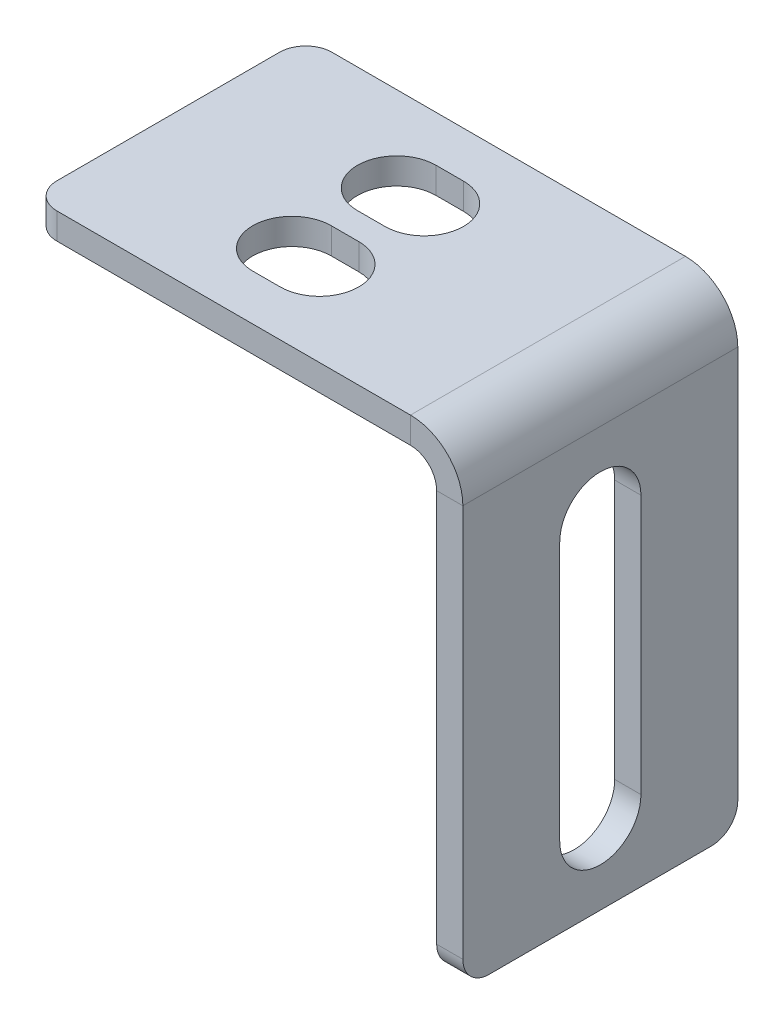
ISO-10303-21;
HEADER;
FILE_DESCRIPTION(('STEP AP214'),'2;1');
FILE_NAME('part.step','',(''),(''),'','','');
FILE_SCHEMA(('AUTOMOTIVE_DESIGN { 1 0 10303 214 1 1 1 1 }'));
ENDSEC;
DATA;
#1=APPLICATION_CONTEXT('core data for automotive mechanical design processes');
#2=APPLICATION_PROTOCOL_DEFINITION('international standard','automotive_design',2000,#1);
#3=PRODUCT_CONTEXT('',#1,'mechanical');
#4=PRODUCT('Part','Part','',(#3));
#5=PRODUCT_RELATED_PRODUCT_CATEGORY('part','',(#4));
#6=PRODUCT_DEFINITION_FORMATION('','',#4);
#7=PRODUCT_DEFINITION_CONTEXT('part definition',#1,'design');
#8=PRODUCT_DEFINITION('design','',#6,#7);
#9=PRODUCT_DEFINITION_SHAPE('','',#8);
#10=(LENGTH_UNIT() NAMED_UNIT(*) SI_UNIT(.MILLI.,.METRE.));
#11=(NAMED_UNIT(*) PLANE_ANGLE_UNIT() SI_UNIT($,.RADIAN.));
#12=(NAMED_UNIT(*) SI_UNIT($,.STERADIAN.) SOLID_ANGLE_UNIT());
#13=UNCERTAINTY_MEASURE_WITH_UNIT(LENGTH_MEASURE(1.E-05),#10,'distance_accuracy_value','');
#14=(GEOMETRIC_REPRESENTATION_CONTEXT(3) GLOBAL_UNCERTAINTY_ASSIGNED_CONTEXT((#13)) GLOBAL_UNIT_ASSIGNED_CONTEXT((#10,
#11,#12)) REPRESENTATION_CONTEXT('',''));
#15=CARTESIAN_POINT('',(0.,0.,0.));
#16=DIRECTION('',(0.,0.,1.));
#17=DIRECTION('',(1.,0.,0.));
#18=AXIS2_PLACEMENT_3D('',#15,#16,#17);
#19=CARTESIAN_POINT('',(-2.,0.,0.));
#20=DIRECTION('',(0.,0.,1.));
#21=DIRECTION('',(0.,1.,0.));
#22=AXIS2_PLACEMENT_3D('',#19,#20,#21);
#23=PLANE('',#22);
#24=DIRECTION('',(0.,-1.,0.));
#25=VECTOR('',#24,1.);
#26=CARTESIAN_POINT('',(0.,0.,0.));
#27=LINE('',#26,#25);
#28=CARTESIAN_POINT('',(0.,-34.,0.));
#29=VERTEX_POINT('',#28);
#30=CARTESIAN_POINT('',(0.,-4.,0.));
#31=VERTEX_POINT('',#30);
#32=EDGE_CURVE('E327',#29,#31,#27,.F.);
#33=ORIENTED_EDGE('',*,*,#32,.F.);
#34=DIRECTION('',(1.,0.,0.));
#35=VECTOR('',#34,1.);
#36=CARTESIAN_POINT('',(-2.,-34.,0.));
#37=LINE('',#36,#35);
#38=CARTESIAN_POINT('',(-2.,-34.,0.));
#39=VERTEX_POINT('',#38);
#40=EDGE_CURVE('E341',#29,#39,#37,.F.);
#41=ORIENTED_EDGE('',*,*,#40,.T.);
#42=DIRECTION('',(0.,1.,0.));
#43=VECTOR('',#42,1.);
#44=CARTESIAN_POINT('',(-2.,0.,0.));
#45=LINE('',#44,#43);
#46=CARTESIAN_POINT('',(-2.,-4.,0.));
#47=VERTEX_POINT('',#46);
#48=EDGE_CURVE('E280',#39,#47,#45,.T.);
#49=ORIENTED_EDGE('',*,*,#48,.T.);
#50=DIRECTION('',(-1.,0.,0.));
#51=VECTOR('',#50,1.);
#52=CARTESIAN_POINT('',(-2.,-4.,0.));
#53=LINE('',#52,#51);
#54=EDGE_CURVE('E338',#31,#47,#53,.T.);
#55=ORIENTED_EDGE('',*,*,#54,.F.);
#56=EDGE_LOOP('',(#33,#41,#49,#55));
#57=FACE_BOUND('',#56,.T.);
#58=ADVANCED_FACE('F16',(#57),#23,.F.);
#59=CARTESIAN_POINT('',(-2.,-36.,70.8364617882991));
#60=DIRECTION('',(0.,1.,0.));
#61=DIRECTION('',(0.,0.,-1.));
#62=AXIS2_PLACEMENT_3D('',#59,#60,#61);
#63=PLANE('',#62);
#64=DIRECTION('',(0.,0.,-1.));
#65=VECTOR('',#64,1.);
#66=CARTESIAN_POINT('',(-2.,-36.,70.8364617882991));
#67=LINE('',#66,#65);
#68=CARTESIAN_POINT('',(-2.,-36.,19.));
#69=VERTEX_POINT('',#68);
#70=CARTESIAN_POINT('',(-2.,-36.,2.));
#71=VERTEX_POINT('',#70);
#72=EDGE_CURVE('E283',#69,#71,#67,.T.);
#73=ORIENTED_EDGE('',*,*,#72,.T.);
#74=DIRECTION('',(1.,0.,0.));
#75=VECTOR('',#74,1.);
#76=CARTESIAN_POINT('',(-2.,-36.,2.));
#77=LINE('',#76,#75);
#78=CARTESIAN_POINT('',(0.,-36.,2.));
#79=VERTEX_POINT('',#78);
#80=EDGE_CURVE('E352',#71,#79,#77,.T.);
#81=ORIENTED_EDGE('',*,*,#80,.T.);
#82=DIRECTION('',(0.,0.,1.));
#83=VECTOR('',#82,1.);
#84=CARTESIAN_POINT('',(0.,-36.,70.8364617882991));
#85=LINE('',#84,#83);
#86=CARTESIAN_POINT('',(0.,-36.,19.));
#87=VERTEX_POINT('',#86);
#88=EDGE_CURVE('E320',#87,#79,#85,.F.);
#89=ORIENTED_EDGE('',*,*,#88,.F.);
#90=DIRECTION('',(1.,0.,0.));
#91=VECTOR('',#90,1.);
#92=CARTESIAN_POINT('',(-2.,-36.,19.));
#93=LINE('',#92,#91);
#94=EDGE_CURVE('E349',#87,#69,#93,.F.);
#95=ORIENTED_EDGE('',*,*,#94,.T.);
#96=EDGE_LOOP('',(#73,#81,#89,#95));
#97=FACE_BOUND('',#96,.T.);
#98=ADVANCED_FACE('F431',(#97),#63,.F.);
#99=CARTESIAN_POINT('',(-2.,0.,21.));
#100=DIRECTION('',(0.,0.,-1.));
#101=DIRECTION('',(0.,-1.,0.));
#102=AXIS2_PLACEMENT_3D('',#99,#100,#101);
#103=PLANE('',#102);
#104=DIRECTION('',(0.,-1.,0.));
#105=VECTOR('',#104,1.);
#106=CARTESIAN_POINT('',(-2.,0.,21.));
#107=LINE('',#106,#105);
#108=CARTESIAN_POINT('',(-2.,-4.,21.));
#109=VERTEX_POINT('',#108);
#110=CARTESIAN_POINT('',(-2.,-34.,21.));
#111=VERTEX_POINT('',#110);
#112=EDGE_CURVE('E277',#109,#111,#107,.T.);
#113=ORIENTED_EDGE('',*,*,#112,.T.);
#114=DIRECTION('',(1.,0.,0.));
#115=VECTOR('',#114,1.);
#116=CARTESIAN_POINT('',(-2.,-34.,21.));
#117=LINE('',#116,#115);
#118=CARTESIAN_POINT('',(0.,-34.,21.));
#119=VERTEX_POINT('',#118);
#120=EDGE_CURVE('E358',#111,#119,#117,.T.);
#121=ORIENTED_EDGE('',*,*,#120,.T.);
#122=DIRECTION('',(0.,-1.,0.));
#123=VECTOR('',#122,1.);
#124=CARTESIAN_POINT('',(0.,0.,21.));
#125=LINE('',#124,#123);
#126=CARTESIAN_POINT('',(0.,-4.,21.));
#127=VERTEX_POINT('',#126);
#128=EDGE_CURVE('E324',#127,#119,#125,.T.);
#129=ORIENTED_EDGE('',*,*,#128,.F.);
#130=DIRECTION('',(-1.,0.,0.));
#131=VECTOR('',#130,1.);
#132=CARTESIAN_POINT('',(-2.,-4.,21.));
#133=LINE('',#132,#131);
#134=EDGE_CURVE('E336',#127,#109,#133,.T.);
#135=ORIENTED_EDGE('',*,*,#134,.T.);
#136=EDGE_LOOP('',(#113,#121,#129,#135));
#137=FACE_BOUND('',#136,.T.);
#138=ADVANCED_FACE('F424',(#137),#103,.F.);
#139=CARTESIAN_POINT('',(-4.,-4.,21.));
#140=DIRECTION('',(0.,0.,1.));
#141=DIRECTION('',(1.,0.,0.));
#142=AXIS2_PLACEMENT_3D('',#139,#140,#141);
#143=PLANE('',#142);
#144=ORIENTED_EDGE('',*,*,#134,.F.);
#145=CARTESIAN_POINT('',(-4.,-4.,21.));
#146=DIRECTION('',(0.,0.,1.));
#147=DIRECTION('',(1.,0.,0.));
#148=AXIS2_PLACEMENT_3D('',#145,#146,#147);
#149=CIRCLE('',#148,4.);
#150=CARTESIAN_POINT('',(-4.,0.,21.));
#151=VERTEX_POINT('',#150);
#152=EDGE_CURVE('E321',#127,#151,#149,.T.);
#153=ORIENTED_EDGE('',*,*,#152,.T.);
#154=DIRECTION('',(0.,-1.,0.));
#155=VECTOR('',#154,1.);
#156=CARTESIAN_POINT('',(-4.,-2.,21.));
#157=LINE('',#156,#155);
#158=CARTESIAN_POINT('',(-4.,-2.,21.));
#159=VERTEX_POINT('',#158);
#160=EDGE_CURVE('E333',#151,#159,#157,.T.);
#161=ORIENTED_EDGE('',*,*,#160,.T.);
#162=CARTESIAN_POINT('',(-4.,-4.,21.));
#163=DIRECTION('',(0.,0.,-1.));
#164=DIRECTION('',(-1.,0.,0.));
#165=AXIS2_PLACEMENT_3D('',#162,#163,#164);
#166=CIRCLE('',#165,2.);
#167=EDGE_CURVE('E281',#109,#159,#166,.F.);
#168=ORIENTED_EDGE('',*,*,#167,.F.);
#169=EDGE_LOOP('',(#144,#153,#161,#168));
#170=FACE_BOUND('',#169,.T.);
#171=ADVANCED_FACE('F417',(#170),#143,.T.);
#172=CARTESIAN_POINT('',(0.,-2.,21.));
#173=DIRECTION('',(0.,0.,-1.));
#174=DIRECTION('',(1.,0.,0.));
#175=AXIS2_PLACEMENT_3D('',#172,#173,#174);
#176=PLANE('',#175);
#177=DIRECTION('',(1.,0.,0.));
#178=VECTOR('',#177,1.);
#179=CARTESIAN_POINT('',(0.,0.,21.));
#180=LINE('',#179,#178);
#181=CARTESIAN_POINT('',(-31.,0.,21.));
#182=VERTEX_POINT('',#181);
#183=EDGE_CURVE('E318',#182,#151,#180,.T.);
#184=ORIENTED_EDGE('',*,*,#183,.F.);
#185=DIRECTION('',(0.,-1.,0.));
#186=VECTOR('',#185,1.);
#187=CARTESIAN_POINT('',(-31.,-2.,21.));
#188=LINE('',#187,#186);
#189=CARTESIAN_POINT('',(-31.,-2.,21.));
#190=VERTEX_POINT('',#189);
#191=EDGE_CURVE('E360',#182,#190,#188,.T.);
#192=ORIENTED_EDGE('',*,*,#191,.T.);
#193=DIRECTION('',(1.,0.,0.));
#194=VECTOR('',#193,1.);
#195=CARTESIAN_POINT('',(0.,-2.,21.));
#196=LINE('',#195,#194);
#197=EDGE_CURVE('E286',#190,#159,#196,.T.);
#198=ORIENTED_EDGE('',*,*,#197,.T.);
#199=ORIENTED_EDGE('',*,*,#160,.F.);
#200=EDGE_LOOP('',(#184,#192,#198,#199));
#201=FACE_BOUND('',#200,.T.);
#202=ADVANCED_FACE('F384',(#201),#176,.F.);
#203=CARTESIAN_POINT('',(-33.,-2.,70.8364617882991));
#204=DIRECTION('',(-1.,0.,0.));
#205=DIRECTION('',(0.,0.,-1.));
#206=AXIS2_PLACEMENT_3D('',#203,#204,#205);
#207=PLANE('',#206);
#208=DIRECTION('',(0.,0.,-1.));
#209=VECTOR('',#208,1.);
#210=CARTESIAN_POINT('',(-33.,-2.,70.8364617882991));
#211=LINE('',#210,#209);
#212=CARTESIAN_POINT('',(-33.,-2.,19.));
#213=VERTEX_POINT('',#212);
#214=CARTESIAN_POINT('',(-33.,-2.,2.));
#215=VERTEX_POINT('',#214);
#216=EDGE_CURVE('E288',#213,#215,#211,.T.);
#217=ORIENTED_EDGE('',*,*,#216,.F.);
#218=DIRECTION('',(0.,1.,0.));
#219=VECTOR('',#218,1.);
#220=CARTESIAN_POINT('',(-33.,-2.,19.));
#221=LINE('',#220,#219);
#222=CARTESIAN_POINT('',(-33.,0.,19.));
#223=VERTEX_POINT('',#222);
#224=EDGE_CURVE('E370',#213,#223,#221,.T.);
#225=ORIENTED_EDGE('',*,*,#224,.T.);
#226=DIRECTION('',(0.,0.,1.));
#227=VECTOR('',#226,1.);
#228=CARTESIAN_POINT('',(-33.,0.,70.8364617882991));
#229=LINE('',#228,#227);
#230=CARTESIAN_POINT('',(-33.,0.,2.));
#231=VERTEX_POINT('',#230);
#232=EDGE_CURVE('E315',#223,#231,#229,.F.);
#233=ORIENTED_EDGE('',*,*,#232,.T.);
#234=DIRECTION('',(0.,1.,0.));
#235=VECTOR('',#234,1.);
#236=CARTESIAN_POINT('',(-33.,-2.,2.));
#237=LINE('',#236,#235);
#238=EDGE_CURVE('E367',#231,#215,#237,.F.);
#239=ORIENTED_EDGE('',*,*,#238,.T.);
#240=EDGE_LOOP('',(#217,#225,#233,#239));
#241=FACE_BOUND('',#240,.T.);
#242=ADVANCED_FACE('F391',(#241),#207,.T.);
#243=CARTESIAN_POINT('',(0.,-2.,0.));
#244=DIRECTION('',(0.,0.,1.));
#245=DIRECTION('',(-1.,0.,0.));
#246=AXIS2_PLACEMENT_3D('',#243,#244,#245);
#247=PLANE('',#246);
#248=DIRECTION('',(-1.,0.,0.));
#249=VECTOR('',#248,1.);
#250=CARTESIAN_POINT('',(0.,-2.,0.));
#251=LINE('',#250,#249);
#252=CARTESIAN_POINT('',(-4.,-2.,0.));
#253=VERTEX_POINT('',#252);
#254=CARTESIAN_POINT('',(-31.,-2.,0.));
#255=VERTEX_POINT('',#254);
#256=EDGE_CURVE('E291',#253,#255,#251,.T.);
#257=ORIENTED_EDGE('',*,*,#256,.T.);
#258=DIRECTION('',(0.,-1.,0.));
#259=VECTOR('',#258,1.);
#260=CARTESIAN_POINT('',(-31.,-2.,0.));
#261=LINE('',#260,#259);
#262=CARTESIAN_POINT('',(-31.,0.,0.));
#263=VERTEX_POINT('',#262);
#264=EDGE_CURVE('E10',#255,#263,#261,.F.);
#265=ORIENTED_EDGE('',*,*,#264,.T.);
#266=DIRECTION('',(1.,0.,0.));
#267=VECTOR('',#266,1.);
#268=CARTESIAN_POINT('',(0.,0.,0.));
#269=LINE('',#268,#267);
#270=CARTESIAN_POINT('',(-4.,0.,0.));
#271=VERTEX_POINT('',#270);
#272=EDGE_CURVE('E312',#271,#263,#269,.F.);
#273=ORIENTED_EDGE('',*,*,#272,.F.);
#274=DIRECTION('',(0.,-1.,0.));
#275=VECTOR('',#274,1.);
#276=CARTESIAN_POINT('',(-4.,-2.,0.));
#277=LINE('',#276,#275);
#278=EDGE_CURVE('E300',#271,#253,#277,.T.);
#279=ORIENTED_EDGE('',*,*,#278,.T.);
#280=EDGE_LOOP('',(#257,#265,#273,#279));
#281=FACE_BOUND('',#280,.T.);
#282=ADVANCED_FACE('F399',(#281),#247,.F.);
#283=CARTESIAN_POINT('',(-4.,-4.,0.));
#284=DIRECTION('',(0.,0.,-1.));
#285=DIRECTION('',(-1.,0.,0.));
#286=AXIS2_PLACEMENT_3D('',#283,#284,#285);
#287=PLANE('',#286);
#288=CARTESIAN_POINT('',(-4.,-4.,0.));
#289=DIRECTION('',(0.,0.,1.));
#290=DIRECTION('',(1.,0.,0.));
#291=AXIS2_PLACEMENT_3D('',#288,#289,#290);
#292=CIRCLE('',#291,4.);
#293=EDGE_CURVE('E246',#271,#31,#292,.F.);
#294=ORIENTED_EDGE('',*,*,#293,.T.);
#295=ORIENTED_EDGE('',*,*,#54,.T.);
#296=CARTESIAN_POINT('',(-4.,-4.,0.));
#297=DIRECTION('',(0.,0.,1.));
#298=DIRECTION('',(1.,0.,0.));
#299=AXIS2_PLACEMENT_3D('',#296,#297,#298);
#300=CIRCLE('',#299,2.);
#301=EDGE_CURVE('E301',#253,#47,#300,.F.);
#302=ORIENTED_EDGE('',*,*,#301,.F.);
#303=ORIENTED_EDGE('',*,*,#278,.F.);
#304=EDGE_LOOP('',(#294,#295,#302,#303));
#305=FACE_BOUND('',#304,.T.);
#306=ADVANCED_FACE('F403',(#305),#287,.T.);
#307=CARTESIAN_POINT('',(0.,-2.,70.8364617882991));
#308=DIRECTION('',(0.,-1.,0.));
#309=DIRECTION('',(1.,0.,0.));
#310=AXIS2_PLACEMENT_3D('',#307,#308,#309);
#311=PLANE('',#310);
#312=CARTESIAN_POINT('',(-17.45,-2.,6.50000000000001));
#313=DIRECTION('',(0.,-1.,0.));
#314=DIRECTION('',(1.,0.,0.));
#315=AXIS2_PLACEMENT_3D('',#312,#313,#314);
#316=CIRCLE('',#315,3.);
#317=CARTESIAN_POINT('',(-17.45,-2.,9.50000000000001));
#318=VERTEX_POINT('',#317);
#319=CARTESIAN_POINT('',(-17.45,-2.,3.50000000000001));
#320=VERTEX_POINT('',#319);
#321=EDGE_CURVE('E220',#318,#320,#316,.F.);
#322=ORIENTED_EDGE('',*,*,#321,.T.);
#323=DIRECTION('',(-1.,0.,0.));
#324=VECTOR('',#323,1.);
#325=CARTESIAN_POINT('',(-17.45,-2.,3.50000000000001));
#326=LINE('',#325,#324);
#327=CARTESIAN_POINT('',(-19.55,-2.,3.5));
#328=VERTEX_POINT('',#327);
#329=EDGE_CURVE('E237',#320,#328,#326,.T.);
#330=ORIENTED_EDGE('',*,*,#329,.T.);
#331=CARTESIAN_POINT('',(-19.55,-2.,6.50000000000001));
#332=DIRECTION('',(0.,-1.,0.));
#333=DIRECTION('',(1.,0.,0.));
#334=AXIS2_PLACEMENT_3D('',#331,#332,#333);
#335=CIRCLE('',#334,3.);
#336=CARTESIAN_POINT('',(-19.55,-2.,9.50000000000001));
#337=VERTEX_POINT('',#336);
#338=EDGE_CURVE('E213',#328,#337,#335,.F.);
#339=ORIENTED_EDGE('',*,*,#338,.T.);
#340=DIRECTION('',(1.,0.,0.));
#341=VECTOR('',#340,1.);
#342=CARTESIAN_POINT('',(-19.55,-2.,9.50000000000001));
#343=LINE('',#342,#341);
#344=EDGE_CURVE('E216',#337,#318,#343,.T.);
#345=ORIENTED_EDGE('',*,*,#344,.T.);
#346=EDGE_LOOP('',(#322,#330,#339,#345));
#347=FACE_BOUND('',#346,.T.);
#348=CARTESIAN_POINT('',(-19.55,-2.,14.5));
#349=DIRECTION('',(0.,-1.,0.));
#350=DIRECTION('',(1.,0.,0.));
#351=AXIS2_PLACEMENT_3D('',#348,#349,#350);
#352=CIRCLE('',#351,3.);
#353=CARTESIAN_POINT('',(-19.55,-2.,11.5));
#354=VERTEX_POINT('',#353);
#355=CARTESIAN_POINT('',(-19.55,-2.,17.5));
#356=VERTEX_POINT('',#355);
#357=EDGE_CURVE('E252',#354,#356,#352,.F.);
#358=ORIENTED_EDGE('',*,*,#357,.T.);
#359=DIRECTION('',(1.,0.,0.));
#360=VECTOR('',#359,1.);
#361=CARTESIAN_POINT('',(-19.55,-2.,17.5));
#362=LINE('',#361,#360);
#363=CARTESIAN_POINT('',(-17.45,-2.,17.5));
#364=VERTEX_POINT('',#363);
#365=EDGE_CURVE('E217',#356,#364,#362,.T.);
#366=ORIENTED_EDGE('',*,*,#365,.T.);
#367=CARTESIAN_POINT('',(-17.45,-2.,14.5));
#368=DIRECTION('',(0.,-1.,0.));
#369=DIRECTION('',(1.,0.,0.));
#370=AXIS2_PLACEMENT_3D('',#367,#368,#369);
#371=CIRCLE('',#370,3.);
#372=CARTESIAN_POINT('',(-17.45,-2.,11.5));
#373=VERTEX_POINT('',#372);
#374=EDGE_CURVE('E190',#364,#373,#371,.F.);
#375=ORIENTED_EDGE('',*,*,#374,.T.);
#376=DIRECTION('',(-1.,0.,0.));
#377=VECTOR('',#376,1.);
#378=CARTESIAN_POINT('',(-17.45,-2.,11.5));
#379=LINE('',#378,#377);
#380=EDGE_CURVE('E249',#373,#354,#379,.T.);
#381=ORIENTED_EDGE('',*,*,#380,.T.);
#382=EDGE_LOOP('',(#358,#366,#375,#381));
#383=FACE_BOUND('',#382,.T.);
#384=ORIENTED_EDGE('',*,*,#197,.F.);
#385=CARTESIAN_POINT('',(-31.,-2.,19.));
#386=DIRECTION('',(0.,-1.,0.));
#387=DIRECTION('',(1.,0.,0.));
#388=AXIS2_PLACEMENT_3D('',#385,#386,#387);
#389=CIRCLE('',#388,2.);
#390=EDGE_CURVE('E365',#190,#213,#389,.T.);
#391=ORIENTED_EDGE('',*,*,#390,.T.);
#392=ORIENTED_EDGE('',*,*,#216,.T.);
#393=CARTESIAN_POINT('',(-31.,-2.,2.));
#394=DIRECTION('',(0.,-1.,0.));
#395=DIRECTION('',(1.,0.,0.));
#396=AXIS2_PLACEMENT_3D('',#393,#394,#395);
#397=CIRCLE('',#396,2.);
#398=EDGE_CURVE('E363',#215,#255,#397,.T.);
#399=ORIENTED_EDGE('',*,*,#398,.T.);
#400=ORIENTED_EDGE('',*,*,#256,.F.);
#401=DIRECTION('',(0.,0.,-1.));
#402=VECTOR('',#401,1.);
#403=CARTESIAN_POINT('',(-4.,-2.,21.));
#404=LINE('',#403,#402);
#405=EDGE_CURVE('E297',#253,#159,#404,.F.);
#406=ORIENTED_EDGE('',*,*,#405,.T.);
#407=EDGE_LOOP('',(#384,#391,#392,#399,#400,#406));
#408=FACE_BOUND('',#407,.T.);
#409=ADVANCED_FACE('F389',(#347,#383,#408),#311,.T.);
#410=CARTESIAN_POINT('',(-2.,0.,70.8364617882991));
#411=DIRECTION('',(-1.,0.,0.));
#412=DIRECTION('',(0.,-1.,0.));
#413=AXIS2_PLACEMENT_3D('',#410,#411,#412);
#414=PLANE('',#413);
#415=CARTESIAN_POINT('',(-2.,-29.9,10.5));
#416=DIRECTION('',(-1.,0.,0.));
#417=DIRECTION('',(0.,-1.,0.));
#418=AXIS2_PLACEMENT_3D('',#415,#416,#417);
#419=CIRCLE('',#418,3.1);
#420=CARTESIAN_POINT('',(-2.,-29.9,7.40000000000001));
#421=VERTEX_POINT('',#420);
#422=CARTESIAN_POINT('',(-2.,-29.9,13.6));
#423=VERTEX_POINT('',#422);
#424=EDGE_CURVE('E31',#421,#423,#419,.T.);
#425=ORIENTED_EDGE('',*,*,#424,.F.);
#426=DIRECTION('',(0.,-1.,0.));
#427=VECTOR('',#426,1.);
#428=CARTESIAN_POINT('',(-2.,-29.9,7.40000000000001));
#429=LINE('',#428,#427);
#430=CARTESIAN_POINT('',(-2.,-10.1,7.4));
#431=VERTEX_POINT('',#430);
#432=EDGE_CURVE('E184',#431,#421,#429,.T.);
#433=ORIENTED_EDGE('',*,*,#432,.F.);
#434=CARTESIAN_POINT('',(-2.,-10.1,10.5));
#435=DIRECTION('',(-1.,0.,0.));
#436=DIRECTION('',(0.,-1.,0.));
#437=AXIS2_PLACEMENT_3D('',#434,#435,#436);
#438=CIRCLE('',#437,3.1);
#439=CARTESIAN_POINT('',(-2.,-10.1,13.6));
#440=VERTEX_POINT('',#439);
#441=EDGE_CURVE('E204',#440,#431,#438,.T.);
#442=ORIENTED_EDGE('',*,*,#441,.F.);
#443=DIRECTION('',(0.,1.,0.));
#444=VECTOR('',#443,1.);
#445=CARTESIAN_POINT('',(-2.,-29.9,13.6));
#446=LINE('',#445,#444);
#447=EDGE_CURVE('E198',#423,#440,#446,.T.);
#448=ORIENTED_EDGE('',*,*,#447,.F.);
#449=EDGE_LOOP('',(#425,#433,#442,#448));
#450=FACE_BOUND('',#449,.T.);
#451=ORIENTED_EDGE('',*,*,#48,.F.);
#452=CARTESIAN_POINT('',(-2.,-34.,2.));
#453=DIRECTION('',(-1.,0.,0.));
#454=DIRECTION('',(0.,-1.,0.));
#455=AXIS2_PLACEMENT_3D('',#452,#453,#454);
#456=CIRCLE('',#455,2.);
#457=EDGE_CURVE('E347',#39,#71,#456,.T.);
#458=ORIENTED_EDGE('',*,*,#457,.T.);
#459=ORIENTED_EDGE('',*,*,#72,.F.);
#460=CARTESIAN_POINT('',(-2.,-34.,19.));
#461=DIRECTION('',(-1.,0.,0.));
#462=DIRECTION('',(0.,-1.,0.));
#463=AXIS2_PLACEMENT_3D('',#460,#461,#462);
#464=CIRCLE('',#463,2.);
#465=EDGE_CURVE('E345',#69,#111,#464,.T.);
#466=ORIENTED_EDGE('',*,*,#465,.T.);
#467=ORIENTED_EDGE('',*,*,#112,.F.);
#468=DIRECTION('',(0.,0.,-1.));
#469=VECTOR('',#468,1.);
#470=CARTESIAN_POINT('',(-2.,-4.,0.));
#471=LINE('',#470,#469);
#472=EDGE_CURVE('E294',#109,#47,#471,.T.);
#473=ORIENTED_EDGE('',*,*,#472,.T.);
#474=EDGE_LOOP('',(#451,#458,#459,#466,#467,#473));
#475=FACE_BOUND('',#474,.T.);
#476=ADVANCED_FACE('F411',(#450,#475),#414,.T.);
#477=CARTESIAN_POINT('',(-4.,-4.,70.8364617882991));
#478=DIRECTION('',(0.,0.,1.));
#479=DIRECTION('',(1.,0.,0.));
#480=AXIS2_PLACEMENT_3D('',#477,#478,#479);
#481=CYLINDRICAL_SURFACE('',#480,2.);
#482=ORIENTED_EDGE('',*,*,#167,.T.);
#483=ORIENTED_EDGE('',*,*,#405,.F.);
#484=ORIENTED_EDGE('',*,*,#301,.T.);
#485=ORIENTED_EDGE('',*,*,#472,.F.);
#486=EDGE_LOOP('',(#482,#483,#484,#485));
#487=FACE_BOUND('',#486,.T.);
#488=ADVANCED_FACE('F407',(#487),#481,.F.);
#489=CARTESIAN_POINT('',(0.,0.,70.8364617882991));
#490=DIRECTION('',(0.,-1.,0.));
#491=DIRECTION('',(1.,0.,0.));
#492=AXIS2_PLACEMENT_3D('',#489,#490,#491);
#493=PLANE('',#492);
#494=DIRECTION('',(-1.,0.,0.));
#495=VECTOR('',#494,1.);
#496=CARTESIAN_POINT('',(-17.45,0.,3.50000000000001));
#497=LINE('',#496,#495);
#498=CARTESIAN_POINT('',(-17.45,0.,3.5));
#499=VERTEX_POINT('',#498);
#500=CARTESIAN_POINT('',(-19.55,0.,3.50000000000001));
#501=VERTEX_POINT('',#500);
#502=EDGE_CURVE('E225',#499,#501,#497,.T.);
#503=ORIENTED_EDGE('',*,*,#502,.F.);
#504=CARTESIAN_POINT('',(-17.45,0.,6.50000000000001));
#505=DIRECTION('',(0.,1.,0.));
#506=DIRECTION('',(-1.,0.,0.));
#507=AXIS2_PLACEMENT_3D('',#504,#505,#506);
#508=CIRCLE('',#507,3.);
#509=CARTESIAN_POINT('',(-17.45,0.,9.50000000000001));
#510=VERTEX_POINT('',#509);
#511=EDGE_CURVE('E223',#510,#499,#508,.T.);
#512=ORIENTED_EDGE('',*,*,#511,.F.);
#513=DIRECTION('',(1.,0.,0.));
#514=VECTOR('',#513,1.);
#515=CARTESIAN_POINT('',(-19.55,0.,9.50000000000001));
#516=LINE('',#515,#514);
#517=CARTESIAN_POINT('',(-19.55,0.,9.50000000000001));
#518=VERTEX_POINT('',#517);
#519=EDGE_CURVE('E231',#518,#510,#516,.T.);
#520=ORIENTED_EDGE('',*,*,#519,.F.);
#521=CARTESIAN_POINT('',(-19.55,0.,6.50000000000001));
#522=DIRECTION('',(0.,1.,0.));
#523=DIRECTION('',(-1.,0.,0.));
#524=AXIS2_PLACEMENT_3D('',#521,#522,#523);
#525=CIRCLE('',#524,3.);
#526=EDGE_CURVE('E228',#501,#518,#525,.T.);
#527=ORIENTED_EDGE('',*,*,#526,.F.);
#528=EDGE_LOOP('',(#503,#512,#520,#527));
#529=FACE_BOUND('',#528,.T.);
#530=DIRECTION('',(1.,0.,0.));
#531=VECTOR('',#530,1.);
#532=CARTESIAN_POINT('',(-19.55,0.,17.5));
#533=LINE('',#532,#531);
#534=CARTESIAN_POINT('',(-19.55,0.,17.5));
#535=VERTEX_POINT('',#534);
#536=CARTESIAN_POINT('',(-17.45,0.,17.5));
#537=VERTEX_POINT('',#536);
#538=EDGE_CURVE('E257',#535,#537,#533,.T.);
#539=ORIENTED_EDGE('',*,*,#538,.F.);
#540=CARTESIAN_POINT('',(-19.55,0.,14.5));
#541=DIRECTION('',(0.,1.,0.));
#542=DIRECTION('',(-1.,0.,0.));
#543=AXIS2_PLACEMENT_3D('',#540,#541,#542);
#544=CIRCLE('',#543,3.);
#545=CARTESIAN_POINT('',(-19.55,0.,11.5));
#546=VERTEX_POINT('',#545);
#547=EDGE_CURVE('E255',#546,#535,#544,.T.);
#548=ORIENTED_EDGE('',*,*,#547,.F.);
#549=DIRECTION('',(-1.,0.,0.));
#550=VECTOR('',#549,1.);
#551=CARTESIAN_POINT('',(-17.45,0.,11.5));
#552=LINE('',#551,#550);
#553=CARTESIAN_POINT('',(-17.45,0.,11.5));
#554=VERTEX_POINT('',#553);
#555=EDGE_CURVE('E263',#554,#546,#552,.T.);
#556=ORIENTED_EDGE('',*,*,#555,.F.);
#557=CARTESIAN_POINT('',(-17.45,0.,14.5));
#558=DIRECTION('',(0.,1.,0.));
#559=DIRECTION('',(-1.,0.,0.));
#560=AXIS2_PLACEMENT_3D('',#557,#558,#559);
#561=CIRCLE('',#560,3.);
#562=EDGE_CURVE('E260',#537,#554,#561,.T.);
#563=ORIENTED_EDGE('',*,*,#562,.F.);
#564=EDGE_LOOP('',(#539,#548,#556,#563));
#565=FACE_BOUND('',#564,.T.);
#566=ORIENTED_EDGE('',*,*,#232,.F.);
#567=CARTESIAN_POINT('',(-31.,0.,19.));
#568=DIRECTION('',(0.,-1.,0.));
#569=DIRECTION('',(1.,0.,0.));
#570=AXIS2_PLACEMENT_3D('',#567,#568,#569);
#571=CIRCLE('',#570,2.);
#572=EDGE_CURVE('E24',#223,#182,#571,.F.);
#573=ORIENTED_EDGE('',*,*,#572,.T.);
#574=ORIENTED_EDGE('',*,*,#183,.T.);
#575=DIRECTION('',(0.,0.,1.));
#576=VECTOR('',#575,1.);
#577=CARTESIAN_POINT('',(-4.,0.,70.8364617882991));
#578=LINE('',#577,#576);
#579=EDGE_CURVE('E304',#271,#151,#578,.T.);
#580=ORIENTED_EDGE('',*,*,#579,.F.);
#581=ORIENTED_EDGE('',*,*,#272,.T.);
#582=CARTESIAN_POINT('',(-31.,0.,2.));
#583=DIRECTION('',(0.,-1.,0.));
#584=DIRECTION('',(1.,0.,0.));
#585=AXIS2_PLACEMENT_3D('',#582,#583,#584);
#586=CIRCLE('',#585,2.);
#587=EDGE_CURVE('E372',#263,#231,#586,.F.);
#588=ORIENTED_EDGE('',*,*,#587,.T.);
#589=EDGE_LOOP('',(#566,#573,#574,#580,#581,#588));
#590=FACE_BOUND('',#589,.T.);
#591=ADVANCED_FACE('F377',(#529,#565,#590),#493,.F.);
#592=CARTESIAN_POINT('',(0.,0.,70.8364617882991));
#593=DIRECTION('',(-1.,0.,0.));
#594=DIRECTION('',(0.,-1.,0.));
#595=AXIS2_PLACEMENT_3D('',#592,#593,#594);
#596=PLANE('',#595);
#597=DIRECTION('',(0.,1.,0.));
#598=VECTOR('',#597,1.);
#599=CARTESIAN_POINT('',(0.,-29.9,7.40000000000001));
#600=LINE('',#599,#598);
#601=CARTESIAN_POINT('',(0.,-29.9,7.40000000000001));
#602=VERTEX_POINT('',#601);
#603=CARTESIAN_POINT('',(0.,-10.1,7.4));
#604=VERTEX_POINT('',#603);
#605=EDGE_CURVE('E196',#602,#604,#600,.T.);
#606=ORIENTED_EDGE('',*,*,#605,.F.);
#607=CARTESIAN_POINT('',(0.,-29.9,10.5));
#608=DIRECTION('',(-1.,0.,0.));
#609=DIRECTION('',(0.,-1.,0.));
#610=AXIS2_PLACEMENT_3D('',#607,#608,#609);
#611=CIRCLE('',#610,3.1);
#612=CARTESIAN_POINT('',(0.,-29.9,13.6));
#613=VERTEX_POINT('',#612);
#614=EDGE_CURVE('E178',#613,#602,#611,.F.);
#615=ORIENTED_EDGE('',*,*,#614,.F.);
#616=DIRECTION('',(0.,-1.,0.));
#617=VECTOR('',#616,1.);
#618=CARTESIAN_POINT('',(0.,-29.9,13.6));
#619=LINE('',#618,#617);
#620=CARTESIAN_POINT('',(0.,-10.1,13.6));
#621=VERTEX_POINT('',#620);
#622=EDGE_CURVE('E187',#621,#613,#619,.T.);
#623=ORIENTED_EDGE('',*,*,#622,.F.);
#624=CARTESIAN_POINT('',(0.,-10.1,10.5));
#625=DIRECTION('',(-1.,0.,0.));
#626=DIRECTION('',(0.,-1.,0.));
#627=AXIS2_PLACEMENT_3D('',#624,#625,#626);
#628=CIRCLE('',#627,3.1);
#629=EDGE_CURVE('E39',#604,#621,#628,.F.);
#630=ORIENTED_EDGE('',*,*,#629,.F.);
#631=EDGE_LOOP('',(#606,#615,#623,#630));
#632=FACE_BOUND('',#631,.T.);
#633=ORIENTED_EDGE('',*,*,#88,.T.);
#634=CARTESIAN_POINT('',(0.,-34.,2.));
#635=DIRECTION('',(-1.,0.,0.));
#636=DIRECTION('',(0.,-1.,0.));
#637=AXIS2_PLACEMENT_3D('',#634,#635,#636);
#638=CIRCLE('',#637,2.);
#639=EDGE_CURVE('E356',#79,#29,#638,.F.);
#640=ORIENTED_EDGE('',*,*,#639,.T.);
#641=ORIENTED_EDGE('',*,*,#32,.T.);
#642=DIRECTION('',(0.,0.,1.));
#643=VECTOR('',#642,1.);
#644=CARTESIAN_POINT('',(0.,-4.,70.8364617882991));
#645=LINE('',#644,#643);
#646=EDGE_CURVE('E309',#127,#31,#645,.F.);
#647=ORIENTED_EDGE('',*,*,#646,.F.);
#648=ORIENTED_EDGE('',*,*,#128,.T.);
#649=CARTESIAN_POINT('',(0.,-34.,19.));
#650=DIRECTION('',(-1.,0.,0.));
#651=DIRECTION('',(0.,-1.,0.));
#652=AXIS2_PLACEMENT_3D('',#649,#650,#651);
#653=CIRCLE('',#652,2.);
#654=EDGE_CURVE('E354',#119,#87,#653,.F.);
#655=ORIENTED_EDGE('',*,*,#654,.T.);
#656=EDGE_LOOP('',(#633,#640,#641,#647,#648,#655));
#657=FACE_BOUND('',#656,.T.);
#658=ADVANCED_FACE('F193',(#632,#657),#596,.F.);
#659=CARTESIAN_POINT('',(-4.,-4.,70.8364617882991));
#660=DIRECTION('',(0.,0.,1.));
#661=DIRECTION('',(1.,0.,0.));
#662=AXIS2_PLACEMENT_3D('',#659,#660,#661);
#663=CYLINDRICAL_SURFACE('',#662,4.);
#664=ORIENTED_EDGE('',*,*,#152,.F.);
#665=ORIENTED_EDGE('',*,*,#646,.T.);
#666=ORIENTED_EDGE('',*,*,#293,.F.);
#667=ORIENTED_EDGE('',*,*,#579,.T.);
#668=EDGE_LOOP('',(#664,#665,#666,#667));
#669=FACE_BOUND('',#668,.T.);
#670=ADVANCED_FACE('F422',(#669),#663,.T.);
#671=CARTESIAN_POINT('',(-2.,-34.,2.));
#672=DIRECTION('',(-1.,0.,0.));
#673=DIRECTION('',(0.,-1.,0.));
#674=AXIS2_PLACEMENT_3D('',#671,#672,#673);
#675=CYLINDRICAL_SURFACE('',#674,2.);
#676=ORIENTED_EDGE('',*,*,#639,.F.);
#677=ORIENTED_EDGE('',*,*,#80,.F.);
#678=ORIENTED_EDGE('',*,*,#457,.F.);
#679=ORIENTED_EDGE('',*,*,#40,.F.);
#680=EDGE_LOOP('',(#676,#677,#678,#679));
#681=FACE_BOUND('',#680,.T.);
#682=ADVANCED_FACE('F436',(#681),#675,.T.);
#683=CARTESIAN_POINT('',(-2.,-34.,19.));
#684=DIRECTION('',(-1.,0.,0.));
#685=DIRECTION('',(0.,-1.,0.));
#686=AXIS2_PLACEMENT_3D('',#683,#684,#685);
#687=CYLINDRICAL_SURFACE('',#686,2.);
#688=ORIENTED_EDGE('',*,*,#654,.F.);
#689=ORIENTED_EDGE('',*,*,#120,.F.);
#690=ORIENTED_EDGE('',*,*,#465,.F.);
#691=ORIENTED_EDGE('',*,*,#94,.F.);
#692=EDGE_LOOP('',(#688,#689,#690,#691));
#693=FACE_BOUND('',#692,.T.);
#694=ADVANCED_FACE('F429',(#693),#687,.T.);
#695=CARTESIAN_POINT('',(-31.,-2.,19.));
#696=DIRECTION('',(0.,1.,0.));
#697=DIRECTION('',(-1.,0.,0.));
#698=AXIS2_PLACEMENT_3D('',#695,#696,#697);
#699=CYLINDRICAL_SURFACE('',#698,2.);
#700=ORIENTED_EDGE('',*,*,#572,.F.);
#701=ORIENTED_EDGE('',*,*,#224,.F.);
#702=ORIENTED_EDGE('',*,*,#390,.F.);
#703=ORIENTED_EDGE('',*,*,#191,.F.);
#704=EDGE_LOOP('',(#700,#701,#702,#703));
#705=FACE_BOUND('',#704,.T.);
#706=ADVANCED_FACE('F386',(#705),#699,.T.);
#707=CARTESIAN_POINT('',(-31.,-2.,2.));
#708=DIRECTION('',(0.,1.,0.));
#709=DIRECTION('',(-1.,0.,0.));
#710=AXIS2_PLACEMENT_3D('',#707,#708,#709);
#711=CYLINDRICAL_SURFACE('',#710,2.);
#712=ORIENTED_EDGE('',*,*,#587,.F.);
#713=ORIENTED_EDGE('',*,*,#264,.F.);
#714=ORIENTED_EDGE('',*,*,#398,.F.);
#715=ORIENTED_EDGE('',*,*,#238,.F.);
#716=EDGE_LOOP('',(#712,#713,#714,#715));
#717=FACE_BOUND('',#716,.T.);
#718=ADVANCED_FACE('F18',(#717),#711,.T.);
#719=CARTESIAN_POINT('',(-19.55,-36.001,14.5));
#720=DIRECTION('',(0.,1.,0.));
#721=DIRECTION('',(-1.,0.,0.));
#722=AXIS2_PLACEMENT_3D('',#719,#720,#721);
#723=CYLINDRICAL_SURFACE('',#722,3.);
#724=DIRECTION('',(0.,1.,0.));
#725=VECTOR('',#724,1.);
#726=CARTESIAN_POINT('',(-19.55,-36.001,11.5));
#727=LINE('',#726,#725);
#728=EDGE_CURVE('E267',#354,#546,#727,.T.);
#729=ORIENTED_EDGE('',*,*,#728,.T.);
#730=ORIENTED_EDGE('',*,*,#547,.T.);
#731=DIRECTION('',(0.,1.,0.));
#732=VECTOR('',#731,1.);
#733=CARTESIAN_POINT('',(-19.55,-36.001,17.5));
#734=LINE('',#733,#732);
#735=EDGE_CURVE('E266',#356,#535,#734,.T.);
#736=ORIENTED_EDGE('',*,*,#735,.F.);
#737=ORIENTED_EDGE('',*,*,#357,.F.);
#738=EDGE_LOOP('',(#729,#730,#736,#737));
#739=FACE_BOUND('',#738,.T.);
#740=ADVANCED_FACE('F457',(#739),#723,.F.);
#741=CARTESIAN_POINT('',(-17.45,-36.001,11.5));
#742=DIRECTION('',(0.,0.,-1.));
#743=DIRECTION('',(-1.,0.,0.));
#744=AXIS2_PLACEMENT_3D('',#741,#742,#743);
#745=PLANE('',#744);
#746=DIRECTION('',(0.,1.,0.));
#747=VECTOR('',#746,1.);
#748=CARTESIAN_POINT('',(-17.45,-36.001,11.5));
#749=LINE('',#748,#747);
#750=EDGE_CURVE('E269',#373,#554,#749,.T.);
#751=ORIENTED_EDGE('',*,*,#750,.T.);
#752=ORIENTED_EDGE('',*,*,#555,.T.);
#753=ORIENTED_EDGE('',*,*,#728,.F.);
#754=ORIENTED_EDGE('',*,*,#380,.F.);
#755=EDGE_LOOP('',(#751,#752,#753,#754));
#756=FACE_BOUND('',#755,.T.);
#757=ADVANCED_FACE('F461',(#756),#745,.F.);
#758=CARTESIAN_POINT('',(-17.45,-36.001,14.5));
#759=DIRECTION('',(0.,1.,0.));
#760=DIRECTION('',(-1.,0.,0.));
#761=AXIS2_PLACEMENT_3D('',#758,#759,#760);
#762=CYLINDRICAL_SURFACE('',#761,3.);
#763=DIRECTION('',(0.,1.,0.));
#764=VECTOR('',#763,1.);
#765=CARTESIAN_POINT('',(-17.45,-36.001,17.5));
#766=LINE('',#765,#764);
#767=EDGE_CURVE('E271',#364,#537,#766,.T.);
#768=ORIENTED_EDGE('',*,*,#767,.T.);
#769=ORIENTED_EDGE('',*,*,#562,.T.);
#770=ORIENTED_EDGE('',*,*,#750,.F.);
#771=ORIENTED_EDGE('',*,*,#374,.F.);
#772=EDGE_LOOP('',(#768,#769,#770,#771));
#773=FACE_BOUND('',#772,.T.);
#774=ADVANCED_FACE('F467',(#773),#762,.F.);
#775=CARTESIAN_POINT('',(-19.55,-36.001,17.5));
#776=DIRECTION('',(0.,0.,1.));
#777=DIRECTION('',(1.,0.,0.));
#778=AXIS2_PLACEMENT_3D('',#775,#776,#777);
#779=PLANE('',#778);
#780=ORIENTED_EDGE('',*,*,#735,.T.);
#781=ORIENTED_EDGE('',*,*,#538,.T.);
#782=ORIENTED_EDGE('',*,*,#767,.F.);
#783=ORIENTED_EDGE('',*,*,#365,.F.);
#784=EDGE_LOOP('',(#780,#781,#782,#783));
#785=FACE_BOUND('',#784,.T.);
#786=ADVANCED_FACE('F472',(#785),#779,.F.);
#787=CARTESIAN_POINT('',(-17.45,-36.001,6.50000000000001));
#788=DIRECTION('',(0.,1.,0.));
#789=DIRECTION('',(-1.,0.,0.));
#790=AXIS2_PLACEMENT_3D('',#787,#788,#789);
#791=CYLINDRICAL_SURFACE('',#790,3.);
#792=DIRECTION('',(0.,1.,0.));
#793=VECTOR('',#792,1.);
#794=CARTESIAN_POINT('',(-17.45,-36.001,9.50000000000001));
#795=LINE('',#794,#793);
#796=EDGE_CURVE('E235',#318,#510,#795,.T.);
#797=ORIENTED_EDGE('',*,*,#796,.T.);
#798=ORIENTED_EDGE('',*,*,#511,.T.);
#799=DIRECTION('',(0.,1.,0.));
#800=VECTOR('',#799,1.);
#801=CARTESIAN_POINT('',(-17.45,-36.001,3.50000000000001));
#802=LINE('',#801,#800);
#803=EDGE_CURVE('E234',#320,#499,#802,.T.);
#804=ORIENTED_EDGE('',*,*,#803,.F.);
#805=ORIENTED_EDGE('',*,*,#321,.F.);
#806=EDGE_LOOP('',(#797,#798,#804,#805));
#807=FACE_BOUND('',#806,.T.);
#808=ADVANCED_FACE('F607',(#807),#791,.F.);
#809=CARTESIAN_POINT('',(-19.55,-36.001,9.50000000000001));
#810=DIRECTION('',(0.,0.,1.));
#811=DIRECTION('',(1.,0.,0.));
#812=AXIS2_PLACEMENT_3D('',#809,#810,#811);
#813=PLANE('',#812);
#814=DIRECTION('',(0.,1.,0.));
#815=VECTOR('',#814,1.);
#816=CARTESIAN_POINT('',(-19.55,-36.001,9.50000000000001));
#817=LINE('',#816,#815);
#818=EDGE_CURVE('E238',#337,#518,#817,.T.);
#819=ORIENTED_EDGE('',*,*,#818,.T.);
#820=ORIENTED_EDGE('',*,*,#519,.T.);
#821=ORIENTED_EDGE('',*,*,#796,.F.);
#822=ORIENTED_EDGE('',*,*,#344,.F.);
#823=EDGE_LOOP('',(#819,#820,#821,#822));
#824=FACE_BOUND('',#823,.T.);
#825=ADVANCED_FACE('F616',(#824),#813,.F.);
#826=CARTESIAN_POINT('',(-19.55,-36.001,6.50000000000001));
#827=DIRECTION('',(0.,1.,0.));
#828=DIRECTION('',(-1.,0.,0.));
#829=AXIS2_PLACEMENT_3D('',#826,#827,#828);
#830=CYLINDRICAL_SURFACE('',#829,3.);
#831=DIRECTION('',(0.,1.,0.));
#832=VECTOR('',#831,1.);
#833=CARTESIAN_POINT('',(-19.55,-36.001,3.50000000000001));
#834=LINE('',#833,#832);
#835=EDGE_CURVE('E240',#328,#501,#834,.T.);
#836=ORIENTED_EDGE('',*,*,#835,.T.);
#837=ORIENTED_EDGE('',*,*,#526,.T.);
#838=ORIENTED_EDGE('',*,*,#818,.F.);
#839=ORIENTED_EDGE('',*,*,#338,.F.);
#840=EDGE_LOOP('',(#836,#837,#838,#839));
#841=FACE_BOUND('',#840,.T.);
#842=ADVANCED_FACE('F626',(#841),#830,.F.);
#843=CARTESIAN_POINT('',(-17.45,-36.001,3.50000000000001));
#844=DIRECTION('',(0.,0.,-1.));
#845=DIRECTION('',(-1.,0.,0.));
#846=AXIS2_PLACEMENT_3D('',#843,#844,#845);
#847=PLANE('',#846);
#848=ORIENTED_EDGE('',*,*,#803,.T.);
#849=ORIENTED_EDGE('',*,*,#502,.T.);
#850=ORIENTED_EDGE('',*,*,#835,.F.);
#851=ORIENTED_EDGE('',*,*,#329,.F.);
#852=EDGE_LOOP('',(#848,#849,#850,#851));
#853=FACE_BOUND('',#852,.T.);
#854=ADVANCED_FACE('F636',(#853),#847,.F.);
#855=CARTESIAN_POINT('',(0.00100000000000794,-29.9,10.5));
#856=DIRECTION('',(-1.,0.,0.));
#857=DIRECTION('',(0.,-1.,0.));
#858=AXIS2_PLACEMENT_3D('',#855,#856,#857);
#859=CYLINDRICAL_SURFACE('',#858,3.1);
#860=ORIENTED_EDGE('',*,*,#614,.T.);
#861=DIRECTION('',(-1.,0.,0.));
#862=VECTOR('',#861,1.);
#863=CARTESIAN_POINT('',(0.00100000000000794,-29.9,7.40000000000001));
#864=LINE('',#863,#862);
#865=EDGE_CURVE('E191',#602,#421,#864,.T.);
#866=ORIENTED_EDGE('',*,*,#865,.T.);
#867=ORIENTED_EDGE('',*,*,#424,.T.);
#868=DIRECTION('',(-1.,0.,0.));
#869=VECTOR('',#868,1.);
#870=CARTESIAN_POINT('',(0.00100000000000794,-29.9,13.6));
#871=LINE('',#870,#869);
#872=EDGE_CURVE('E174',#613,#423,#871,.T.);
#873=ORIENTED_EDGE('',*,*,#872,.F.);
#874=EDGE_LOOP('',(#860,#866,#867,#873));
#875=FACE_BOUND('',#874,.T.);
#876=ADVANCED_FACE('F176',(#875),#859,.F.);
#877=CARTESIAN_POINT('',(0.00100000000000794,-29.9,7.40000000000001));
#878=DIRECTION('',(0.,0.,-1.));
#879=DIRECTION('',(0.,1.,0.));
#880=AXIS2_PLACEMENT_3D('',#877,#878,#879);
#881=PLANE('',#880);
#882=ORIENTED_EDGE('',*,*,#605,.T.);
#883=DIRECTION('',(-1.,0.,0.));
#884=VECTOR('',#883,1.);
#885=CARTESIAN_POINT('',(0.00100000000000577,-10.1,7.4));
#886=LINE('',#885,#884);
#887=EDGE_CURVE('E210',#604,#431,#886,.T.);
#888=ORIENTED_EDGE('',*,*,#887,.T.);
#889=ORIENTED_EDGE('',*,*,#432,.T.);
#890=ORIENTED_EDGE('',*,*,#865,.F.);
#891=EDGE_LOOP('',(#882,#888,#889,#890));
#892=FACE_BOUND('',#891,.T.);
#893=ADVANCED_FACE('F655',(#892),#881,.F.);
#894=CARTESIAN_POINT('',(0.00100000000000577,-10.1,10.5));
#895=DIRECTION('',(-1.,0.,0.));
#896=DIRECTION('',(0.,-1.,0.));
#897=AXIS2_PLACEMENT_3D('',#894,#895,#896);
#898=CYLINDRICAL_SURFACE('',#897,3.1);
#899=ORIENTED_EDGE('',*,*,#629,.T.);
#900=DIRECTION('',(-1.,0.,0.));
#901=VECTOR('',#900,1.);
#902=CARTESIAN_POINT('',(0.00100000000000577,-10.1,13.6));
#903=LINE('',#902,#901);
#904=EDGE_CURVE('E183',#621,#440,#903,.T.);
#905=ORIENTED_EDGE('',*,*,#904,.T.);
#906=ORIENTED_EDGE('',*,*,#441,.T.);
#907=ORIENTED_EDGE('',*,*,#887,.F.);
#908=EDGE_LOOP('',(#899,#905,#906,#907));
#909=FACE_BOUND('',#908,.T.);
#910=ADVANCED_FACE('F664',(#909),#898,.F.);
#911=CARTESIAN_POINT('',(0.00100000000000794,-29.9,13.6));
#912=DIRECTION('',(0.,0.,1.));
#913=DIRECTION('',(0.,-1.,0.));
#914=AXIS2_PLACEMENT_3D('',#911,#912,#913);
#915=PLANE('',#914);
#916=ORIENTED_EDGE('',*,*,#622,.T.);
#917=ORIENTED_EDGE('',*,*,#872,.T.);
#918=ORIENTED_EDGE('',*,*,#447,.T.);
#919=ORIENTED_EDGE('',*,*,#904,.F.);
#920=EDGE_LOOP('',(#916,#917,#918,#919));
#921=FACE_BOUND('',#920,.T.);
#922=ADVANCED_FACE('F188',(#921),#915,.F.);
#923=CLOSED_SHELL('',(#58,#98,#138,#171,#202,#242,#282,#306,#409,#476,#488,#591,#658,#670,#682,
#694,#706,#718,#740,#757,#774,#786,#808,#825,#842,#854,#876,#893,#910,#922));
#924=MANIFOLD_SOLID_BREP('B1',#923);
#925=ADVANCED_BREP_SHAPE_REPRESENTATION('',(#18,#924),#14);
#926=SHAPE_DEFINITION_REPRESENTATION(#9,#925);
ENDSEC;
END-ISO-10303-21;
